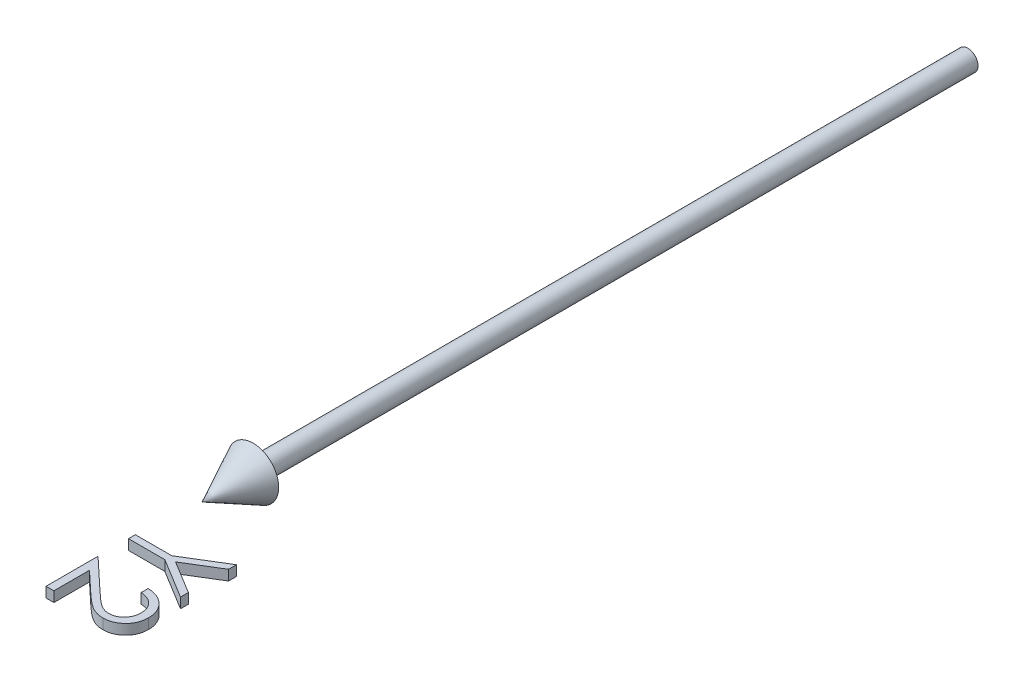
ISO-10303-21;
HEADER;
FILE_DESCRIPTION(('STEP AP214'),'2;1');
FILE_NAME('part.step','',(''),(''),'','','');
FILE_SCHEMA(('AUTOMOTIVE_DESIGN { 1 0 10303 214 1 1 1 1 }'));
ENDSEC;
DATA;
#1=APPLICATION_CONTEXT('core data for automotive mechanical design processes');
#2=APPLICATION_PROTOCOL_DEFINITION('international standard','automotive_design',2000,#1);
#3=PRODUCT_CONTEXT('',#1,'mechanical');
#4=PRODUCT('Part','Part','',(#3));
#5=PRODUCT_RELATED_PRODUCT_CATEGORY('part','',(#4));
#6=PRODUCT_DEFINITION_FORMATION('','',#4);
#7=PRODUCT_DEFINITION_CONTEXT('part definition',#1,'design');
#8=PRODUCT_DEFINITION('design','',#6,#7);
#9=PRODUCT_DEFINITION_SHAPE('','',#8);
#10=(LENGTH_UNIT() NAMED_UNIT(*) SI_UNIT(.MILLI.,.METRE.));
#11=(NAMED_UNIT(*) PLANE_ANGLE_UNIT() SI_UNIT($,.RADIAN.));
#12=(NAMED_UNIT(*) SI_UNIT($,.STERADIAN.) SOLID_ANGLE_UNIT());
#13=UNCERTAINTY_MEASURE_WITH_UNIT(LENGTH_MEASURE(1.E-05),#10,'distance_accuracy_value','');
#14=(GEOMETRIC_REPRESENTATION_CONTEXT(3) GLOBAL_UNCERTAINTY_ASSIGNED_CONTEXT((#13)) GLOBAL_UNIT_ASSIGNED_CONTEXT((#10,
#11,#12)) REPRESENTATION_CONTEXT('',''));
#15=CARTESIAN_POINT('',(0.,0.,0.));
#16=DIRECTION('',(0.,0.,1.));
#17=DIRECTION('',(1.,0.,0.));
#18=AXIS2_PLACEMENT_3D('',#15,#16,#17);
#19=CARTESIAN_POINT('',(13.8461538461538,1.,175.784254807692));
#20=CARTESIAN_POINT('',(13.8430903490205,1.,175.666950718059));
#21=CARTESIAN_POINT('',(13.8370741464776,1.,175.436584854593));
#22=CARTESIAN_POINT('',(13.7949638662532,1.,175.098367814316));
#23=CARTESIAN_POINT('',(13.7223866960572,1.,174.775687595804));
#24=CARTESIAN_POINT('',(13.6228849335806,1.,174.467891000634));
#25=CARTESIAN_POINT('',(13.4976114257859,1.,174.174681471077));
#26=CARTESIAN_POINT('',(13.3385672755579,1.,173.898710206654));
#27=CARTESIAN_POINT('',(13.1519621531288,1.,173.637457681242));
#28=CARTESIAN_POINT('',(12.9392424998358,1.,173.39140372161));
#29=CARTESIAN_POINT('',(12.701290356588,1.,173.165318738488));
#30=CARTESIAN_POINT('',(12.4393013545376,1.,172.962502138375));
#31=CARTESIAN_POINT('',(12.151571288189,1.,172.78952101788));
#32=CARTESIAN_POINT('',(11.8445991098928,1.,172.63618103993));
#33=CARTESIAN_POINT('',(11.5102228136177,1.,172.518853262642));
#34=CARTESIAN_POINT('',(11.1565451045167,1.,172.418562607741));
#35=CARTESIAN_POINT('',(10.7785410693277,1.,172.345708862392));
#36=CARTESIAN_POINT('',(10.5181048480713,1.,172.320574964717));
#37=CARTESIAN_POINT('',(10.3846153846154,1.,172.307692307692));
#38=B_SPLINE_CURVE_WITH_KNOTS('',3,(#19,#20,#21,#22,#23,#24,#25,#26,#27,#28,#29,#30,#31,#32,#33,
#34,#35,#36,#37),.UNSPECIFIED.,.F.,.F.,(4,1,1,1,1,1,1,1,1,1,1,1,1,1,1,1,4),(0.,
0.0644508040395069,0.126570737388967,0.186922340350207,0.245923829149238,0.304098129184294,
0.361780924437368,0.420576707079651,0.480272294873436,0.540223571985138,0.600657929141347,
0.66191615201073,0.724434636865271,0.788852535054683,0.856286703958642,0.926338161844397,1.),.UNSPECIFIED.);
#39=DIRECTION('',(0.,-1.,0.));
#40=VECTOR('',#39,1.);
#41=SURFACE_OF_LINEAR_EXTRUSION('',#38,#40);
#42=DIRECTION('',(0.,-1.,0.));
#43=VECTOR('',#42,1.);
#44=CARTESIAN_POINT('',(10.3846153846154,1.,172.307692307692));
#45=LINE('',#44,#43);
#46=CARTESIAN_POINT('',(10.3846153846154,1.,172.307692307692));
#47=VERTEX_POINT('',#46);
#48=CARTESIAN_POINT('',(10.3846153846154,-1.,172.307692307692));
#49=VERTEX_POINT('',#48);
#50=EDGE_CURVE('E50',#47,#49,#45,.T.);
#51=ORIENTED_EDGE('',*,*,#50,.T.);
#52=CARTESIAN_POINT('',(13.8461538461538,-1.,175.784254807692));
#53=CARTESIAN_POINT('',(13.8430903490205,-1.,175.666950718059));
#54=CARTESIAN_POINT('',(13.8370741464776,-1.,175.436584854593));
#55=CARTESIAN_POINT('',(13.7949638662532,-1.,175.098367814316));
#56=CARTESIAN_POINT('',(13.7223866960572,-1.,174.775687595804));
#57=CARTESIAN_POINT('',(13.6228849335806,-1.,174.467891000634));
#58=CARTESIAN_POINT('',(13.4976114257859,-1.,174.174681471077));
#59=CARTESIAN_POINT('',(13.3385672755579,-1.,173.898710206654));
#60=CARTESIAN_POINT('',(13.1519621531288,-1.,173.637457681242));
#61=CARTESIAN_POINT('',(12.9392424998358,-1.,173.39140372161));
#62=CARTESIAN_POINT('',(12.701290356588,-1.,173.165318738488));
#63=CARTESIAN_POINT('',(12.4393013545376,-1.,172.962502138375));
#64=CARTESIAN_POINT('',(12.151571288189,-1.,172.78952101788));
#65=CARTESIAN_POINT('',(11.8445991098928,-1.,172.63618103993));
#66=CARTESIAN_POINT('',(11.5102228136177,-1.,172.518853262642));
#67=CARTESIAN_POINT('',(11.1565451045167,-1.,172.418562607741));
#68=CARTESIAN_POINT('',(10.7785410693277,-1.,172.345708862392));
#69=CARTESIAN_POINT('',(10.5181048480713,-1.,172.320574964717));
#70=CARTESIAN_POINT('',(10.3846153846154,-1.,172.307692307692));
#71=B_SPLINE_CURVE_WITH_KNOTS('',3,(#52,#53,#54,#55,#56,#57,#58,#59,#60,#61,#62,#63,#64,#65,#66,
#67,#68,#69,#70),.UNSPECIFIED.,.F.,.F.,(4,1,1,1,1,1,1,1,1,1,1,1,1,1,1,1,4),(0.,
0.0644508040395069,0.126570737388967,0.186922340350207,0.245923829149238,0.304098129184294,
0.361780924437368,0.420576707079651,0.480272294873436,0.540223571985138,0.600657929141347,
0.66191615201073,0.724434636865271,0.788852535054683,0.856286703958642,0.926338161844397,1.),.UNSPECIFIED.);
#72=CARTESIAN_POINT('',(13.8461538461538,-1.,175.784254807692));
#73=VERTEX_POINT('',#72);
#74=EDGE_CURVE('E135',#73,#49,#71,.T.);
#75=ORIENTED_EDGE('',*,*,#74,.F.);
#76=DIRECTION('',(0.,-1.,0.));
#77=VECTOR('',#76,1.);
#78=CARTESIAN_POINT('',(13.8461538461538,1.,175.784254807692));
#79=LINE('',#78,#77);
#80=CARTESIAN_POINT('',(13.8461538461538,1.,175.784254807692));
#81=VERTEX_POINT('',#80);
#82=EDGE_CURVE('E12',#81,#73,#79,.T.);
#83=ORIENTED_EDGE('',*,*,#82,.F.);
#84=EDGE_CURVE('E136',#81,#47,#38,.T.);
#85=ORIENTED_EDGE('',*,*,#84,.T.);
#86=EDGE_LOOP('',(#51,#75,#83,#85));
#87=FACE_BOUND('',#86,.T.);
#88=ADVANCED_FACE('F46',(#87),#41,.T.);
#89=CARTESIAN_POINT('',(10.8052884615385,1.,179.038461538461));
#90=CARTESIAN_POINT('',(10.907648621887,1.,179.035764915721));
#91=CARTESIAN_POINT('',(11.1093808418776,1.,179.030450390128));
#92=CARTESIAN_POINT('',(11.4049575306741,1.,178.982658693181));
#93=CARTESIAN_POINT('',(11.6911812335126,1.,178.912443204752));
#94=CARTESIAN_POINT('',(11.9645129994275,1.,178.804219446614));
#95=CARTESIAN_POINT('',(12.2303287358917,1.,178.674192585995));
#96=CARTESIAN_POINT('',(12.4805468155156,1.,178.50807368318));
#97=CARTESIAN_POINT('',(12.7236965720784,1.,178.318243399908));
#98=CARTESIAN_POINT('',(12.9514406019576,1.,178.098049582473));
#99=CARTESIAN_POINT('',(13.1600894980569,1.,177.856317685058));
#100=CARTESIAN_POINT('',(13.3449030478262,1.,177.600905463265));
#101=CARTESIAN_POINT('',(13.4993574131545,1.,177.330692895708));
#102=CARTESIAN_POINT('',(13.6259721242595,1.,177.046806077852));
#103=CARTESIAN_POINT('',(13.725295261767,1.,176.750039938021));
#104=CARTESIAN_POINT('',(13.7941177246169,1.,176.439819559058));
#105=CARTESIAN_POINT('',(13.837328375683,1.,176.11700235811));
#106=CARTESIAN_POINT('',(13.8431748259449,1.,175.896573089243));
#107=CARTESIAN_POINT('',(13.8461538461538,1.,175.784254807692));
#108=B_SPLINE_CURVE_WITH_KNOTS('',3,(#89,#90,#91,#92,#93,#94,#95,#96,#97,#98,#99,#100,#101,#102,
#103,#104,#105,#106,#107),.UNSPECIFIED.,.F.,.F.,(4,1,1,1,1,1,1,1,1,1,1,1,1,1,1,1,4),(0.,
0.0619690391917485,0.122129076432336,0.180999124191659,0.240162416544851,0.299864722747891,
0.359951267092581,0.421741789380327,0.486545679012397,0.551508471493566,0.614994937234004,
0.677239665827439,0.739714679741424,0.803038538094396,0.86648729283315,0.931969479773336,1.),.UNSPECIFIED.);
#109=DIRECTION('',(0.,-1.,0.));
#110=VECTOR('',#109,1.);
#111=SURFACE_OF_LINEAR_EXTRUSION('',#108,#110);
#112=ORIENTED_EDGE('',*,*,#82,.T.);
#113=CARTESIAN_POINT('',(10.8052884615385,-1.,179.038461538461));
#114=CARTESIAN_POINT('',(10.907648621887,-1.,179.035764915721));
#115=CARTESIAN_POINT('',(11.1093808418776,-1.,179.030450390128));
#116=CARTESIAN_POINT('',(11.4049575306741,-1.,178.982658693181));
#117=CARTESIAN_POINT('',(11.6911812335126,-1.,178.912443204752));
#118=CARTESIAN_POINT('',(11.9645129994275,-1.,178.804219446614));
#119=CARTESIAN_POINT('',(12.2303287358917,-1.,178.674192585995));
#120=CARTESIAN_POINT('',(12.4805468155156,-1.,178.50807368318));
#121=CARTESIAN_POINT('',(12.7236965720784,-1.,178.318243399908));
#122=CARTESIAN_POINT('',(12.9514406019576,-1.,178.098049582473));
#123=CARTESIAN_POINT('',(13.1600894980569,-1.,177.856317685058));
#124=CARTESIAN_POINT('',(13.3449030478262,-1.,177.600905463265));
#125=CARTESIAN_POINT('',(13.4993574131545,-1.,177.330692895708));
#126=CARTESIAN_POINT('',(13.6259721242595,-1.,177.046806077852));
#127=CARTESIAN_POINT('',(13.725295261767,-1.,176.750039938021));
#128=CARTESIAN_POINT('',(13.7941177246169,-1.,176.439819559058));
#129=CARTESIAN_POINT('',(13.837328375683,-1.,176.11700235811));
#130=CARTESIAN_POINT('',(13.8431748259449,-1.,175.896573089243));
#131=CARTESIAN_POINT('',(13.8461538461538,-1.,175.784254807692));
#132=B_SPLINE_CURVE_WITH_KNOTS('',3,(#113,#114,#115,#116,#117,#118,#119,#120,#121,#122,#123,
#124,#125,#126,#127,#128,#129,#130,#131),.UNSPECIFIED.,.F.,.F.,(4,1,1,1,1,1,1,1,1,1,1,1,1,1,1,1,
4),(0.,0.0619690391917485,0.122129076432336,0.180999124191659,0.240162416544851,
0.299864722747891,0.359951267092581,0.421741789380327,0.486545679012397,0.551508471493566,
0.614994937234004,0.677239665827439,0.739714679741424,0.803038538094396,0.86648729283315,
0.931969479773336,1.),.UNSPECIFIED.);
#133=CARTESIAN_POINT('',(10.8052884615385,-1.,179.038461538461));
#134=VERTEX_POINT('',#133);
#135=EDGE_CURVE('E153',#134,#73,#132,.T.);
#136=ORIENTED_EDGE('',*,*,#135,.F.);
#137=DIRECTION('',(0.,-1.,0.));
#138=VECTOR('',#137,1.);
#139=CARTESIAN_POINT('',(10.8052884615385,1.,179.038461538461));
#140=LINE('',#139,#138);
#141=CARTESIAN_POINT('',(10.8052884615385,1.,179.038461538461));
#142=VERTEX_POINT('',#141);
#143=EDGE_CURVE('E55',#142,#134,#140,.T.);
#144=ORIENTED_EDGE('',*,*,#143,.F.);
#145=EDGE_CURVE('E141',#142,#81,#108,.T.);
#146=ORIENTED_EDGE('',*,*,#145,.T.);
#147=EDGE_LOOP('',(#112,#136,#144,#146));
#148=FACE_BOUND('',#147,.T.);
#149=ADVANCED_FACE('F248',(#148),#111,.T.);
#150=CARTESIAN_POINT('',(6.20793269230769,1.,176.201923076923));
#151=CARTESIAN_POINT('',(6.35577451350385,1.,176.343566905076));
#152=CARTESIAN_POINT('',(6.63974839534769,1.,176.615635710738));
#153=CARTESIAN_POINT('',(7.05446717563904,1.,177.00028625556));
#154=CARTESIAN_POINT('',(7.43875575802217,1.,177.346320010716));
#155=CARTESIAN_POINT('',(7.79431701645155,1.,177.653966515673));
#156=CARTESIAN_POINT('',(8.11913525102183,1.,177.923478904145));
#157=CARTESIAN_POINT('',(8.41575598564455,1.,178.153994854752));
#158=CARTESIAN_POINT('',(8.68163370775044,1.,178.346533206419));
#159=CARTESIAN_POINT('',(8.99397573851116,1.,178.550583736915));
#160=CARTESIAN_POINT('',(9.37577943995211,1.,178.745159458079));
#161=CARTESIAN_POINT('',(9.84001655898879,1.,178.916171607461));
#162=CARTESIAN_POINT('',(10.3189691013218,1.,179.019700036082));
#163=CARTESIAN_POINT('',(10.6425330310132,1.,179.03218266773));
#164=CARTESIAN_POINT('',(10.8052884615385,1.,179.038461538461));
#165=B_SPLINE_CURVE_WITH_KNOTS('',3,(#150,#151,#152,#153,#154,#155,#156,#157,#158,#159,#160,
#161,#162,#163,#164),.UNSPECIFIED.,.F.,.F.,(4,1,1,1,1,1,1,1,1,1,1,1,4),(0.,0.110794173487163,
0.212812932607773,0.306077909891767,0.390617458060213,0.467232726697906,0.534450618381699,
0.593866801498851,0.644832968632605,0.736220618800178,0.825037401666782,0.911992313096533,1.),.UNSPECIFIED.);
#166=DIRECTION('',(0.,-1.,0.));
#167=VECTOR('',#166,1.);
#168=SURFACE_OF_LINEAR_EXTRUSION('',#165,#167);
#169=ORIENTED_EDGE('',*,*,#143,.T.);
#170=CARTESIAN_POINT('',(6.20793269230769,-1.,176.201923076923));
#171=CARTESIAN_POINT('',(6.35577451350385,-1.,176.343566905076));
#172=CARTESIAN_POINT('',(6.63974839534769,-1.,176.615635710738));
#173=CARTESIAN_POINT('',(7.05446717563904,-1.,177.00028625556));
#174=CARTESIAN_POINT('',(7.43875575802217,-1.,177.346320010716));
#175=CARTESIAN_POINT('',(7.79431701645155,-1.,177.653966515673));
#176=CARTESIAN_POINT('',(8.11913525102183,-1.,177.923478904145));
#177=CARTESIAN_POINT('',(8.41575598564455,-1.,178.153994854752));
#178=CARTESIAN_POINT('',(8.68163370775044,-1.,178.346533206419));
#179=CARTESIAN_POINT('',(8.99397573851116,-1.,178.550583736915));
#180=CARTESIAN_POINT('',(9.37577943995211,-1.,178.745159458079));
#181=CARTESIAN_POINT('',(9.84001655898879,-1.,178.916171607461));
#182=CARTESIAN_POINT('',(10.3189691013218,-1.,179.019700036082));
#183=CARTESIAN_POINT('',(10.6425330310132,-1.,179.03218266773));
#184=CARTESIAN_POINT('',(10.8052884615385,-1.,179.038461538461));
#185=B_SPLINE_CURVE_WITH_KNOTS('',3,(#170,#171,#172,#173,#174,#175,#176,#177,#178,#179,#180,
#181,#182,#183,#184),.UNSPECIFIED.,.F.,.F.,(4,1,1,1,1,1,1,1,1,1,1,1,4),(0.,0.110794173487163,
0.212812932607773,0.306077909891767,0.390617458060213,0.467232726697906,0.534450618381699,
0.593866801498851,0.644832968632605,0.736220618800178,0.825037401666782,0.911992313096533,1.),.UNSPECIFIED.);
#186=CARTESIAN_POINT('',(6.20793269230769,-1.,176.201923076923));
#187=VERTEX_POINT('',#186);
#188=EDGE_CURVE('E198',#187,#134,#185,.T.);
#189=ORIENTED_EDGE('',*,*,#188,.F.);
#190=DIRECTION('',(0.,-1.,0.));
#191=VECTOR('',#190,1.);
#192=CARTESIAN_POINT('',(6.20793269230769,1.,176.201923076923));
#193=LINE('',#192,#191);
#194=CARTESIAN_POINT('',(6.20793269230769,1.,176.201923076923));
#195=VERTEX_POINT('',#194);
#196=EDGE_CURVE('E277',#195,#187,#193,.T.);
#197=ORIENTED_EDGE('',*,*,#196,.F.);
#198=EDGE_CURVE('E267',#195,#142,#165,.T.);
#199=ORIENTED_EDGE('',*,*,#198,.T.);
#200=EDGE_LOOP('',(#169,#189,#197,#199));
#201=FACE_BOUND('',#200,.T.);
#202=ADVANCED_FACE('F252',(#201),#168,.T.);
#203=CARTESIAN_POINT('',(0.,1.,170.384615384615));
#204=DIRECTION('',(0.683776631973392,0.,-0.729691385153425));
#205=DIRECTION('',(-0.729691385153425,0.,-0.683776631973392));
#206=AXIS2_PLACEMENT_3D('',#203,#204,#205);
#207=PLANE('',#206);
#208=ORIENTED_EDGE('',*,*,#196,.T.);
#209=DIRECTION('',(0.729691385153425,0.,0.683776631973392));
#210=VECTOR('',#209,1.);
#211=CARTESIAN_POINT('',(0.,-1.,170.384615384615));
#212=LINE('',#211,#210);
#213=CARTESIAN_POINT('',(0.,-1.,170.384615384615));
#214=VERTEX_POINT('',#213);
#215=EDGE_CURVE('E195',#214,#187,#212,.T.);
#216=ORIENTED_EDGE('',*,*,#215,.F.);
#217=DIRECTION('',(0.,-1.,0.));
#218=VECTOR('',#217,1.);
#219=CARTESIAN_POINT('',(0.,1.,170.384615384615));
#220=LINE('',#219,#218);
#221=CARTESIAN_POINT('',(0.,1.,170.384615384615));
#222=VERTEX_POINT('',#221);
#223=EDGE_CURVE('E279',#222,#214,#220,.T.);
#224=ORIENTED_EDGE('',*,*,#223,.F.);
#225=DIRECTION('',(0.729691385153425,0.,0.683776631973392));
#226=VECTOR('',#225,1.);
#227=CARTESIAN_POINT('',(0.,1.,170.384615384615));
#228=LINE('',#227,#226);
#229=EDGE_CURVE('E340',#222,#195,#228,.T.);
#230=ORIENTED_EDGE('',*,*,#229,.T.);
#231=EDGE_LOOP('',(#208,#216,#224,#230));
#232=FACE_BOUND('',#231,.T.);
#233=ADVANCED_FACE('F257',(#232),#207,.T.);
#234=CARTESIAN_POINT('',(0.,1.,180.576923076923));
#235=DIRECTION('',(-1.,0.,0.));
#236=DIRECTION('',(0.,0.,1.));
#237=AXIS2_PLACEMENT_3D('',#234,#235,#236);
#238=PLANE('',#237);
#239=ORIENTED_EDGE('',*,*,#223,.T.);
#240=DIRECTION('',(0.,0.,-1.));
#241=VECTOR('',#240,1.);
#242=CARTESIAN_POINT('',(0.,-1.,180.576923076923));
#243=LINE('',#242,#241);
#244=CARTESIAN_POINT('',(0.,-1.,180.576923076923));
#245=VERTEX_POINT('',#244);
#246=EDGE_CURVE('E192',#245,#214,#243,.T.);
#247=ORIENTED_EDGE('',*,*,#246,.F.);
#248=DIRECTION('',(0.,-1.,0.));
#249=VECTOR('',#248,1.);
#250=CARTESIAN_POINT('',(0.,1.,180.576923076923));
#251=LINE('',#250,#249);
#252=CARTESIAN_POINT('',(0.,1.,180.576923076923));
#253=VERTEX_POINT('',#252);
#254=EDGE_CURVE('E281',#253,#245,#251,.T.);
#255=ORIENTED_EDGE('',*,*,#254,.F.);
#256=DIRECTION('',(0.,0.,-1.));
#257=VECTOR('',#256,1.);
#258=CARTESIAN_POINT('',(0.,1.,180.576923076923));
#259=LINE('',#258,#257);
#260=EDGE_CURVE('E345',#253,#222,#259,.T.);
#261=ORIENTED_EDGE('',*,*,#260,.T.);
#262=EDGE_LOOP('',(#239,#247,#255,#261));
#263=FACE_BOUND('',#262,.T.);
#264=ADVANCED_FACE('F329',(#263),#238,.T.);
#265=CARTESIAN_POINT('',(1.53846153846154,1.,180.576923076923));
#266=DIRECTION('',(0.,0.,1.));
#267=DIRECTION('',(1.,0.,0.));
#268=AXIS2_PLACEMENT_3D('',#265,#266,#267);
#269=PLANE('',#268);
#270=ORIENTED_EDGE('',*,*,#254,.T.);
#271=DIRECTION('',(-1.,0.,0.));
#272=VECTOR('',#271,1.);
#273=CARTESIAN_POINT('',(1.53846153846154,-1.,180.576923076923));
#274=LINE('',#273,#272);
#275=CARTESIAN_POINT('',(1.53846153846154,-1.,180.576923076923));
#276=VERTEX_POINT('',#275);
#277=EDGE_CURVE('E189',#276,#245,#274,.T.);
#278=ORIENTED_EDGE('',*,*,#277,.F.);
#279=DIRECTION('',(0.,-1.,0.));
#280=VECTOR('',#279,1.);
#281=CARTESIAN_POINT('',(1.53846153846154,1.,180.576923076923));
#282=LINE('',#281,#280);
#283=CARTESIAN_POINT('',(1.53846153846154,1.,180.576923076923));
#284=VERTEX_POINT('',#283);
#285=EDGE_CURVE('E283',#284,#276,#282,.T.);
#286=ORIENTED_EDGE('',*,*,#285,.F.);
#287=DIRECTION('',(-1.,0.,0.));
#288=VECTOR('',#287,1.);
#289=CARTESIAN_POINT('',(1.53846153846154,1.,180.576923076923));
#290=LINE('',#289,#288);
#291=EDGE_CURVE('E347',#284,#253,#290,.T.);
#292=ORIENTED_EDGE('',*,*,#291,.T.);
#293=EDGE_LOOP('',(#270,#278,#286,#292));
#294=FACE_BOUND('',#293,.T.);
#295=ADVANCED_FACE('F325',(#294),#269,.T.);
#296=CARTESIAN_POINT('',(1.53846153846154,1.,173.596754807692));
#297=DIRECTION('',(1.,0.,0.));
#298=DIRECTION('',(0.,0.,-1.));
#299=AXIS2_PLACEMENT_3D('',#296,#297,#298);
#300=PLANE('',#299);
#301=ORIENTED_EDGE('',*,*,#285,.T.);
#302=DIRECTION('',(0.,0.,1.));
#303=VECTOR('',#302,1.);
#304=CARTESIAN_POINT('',(1.53846153846154,-1.,173.596754807692));
#305=LINE('',#304,#303);
#306=CARTESIAN_POINT('',(1.53846153846154,-1.,173.596754807692));
#307=VERTEX_POINT('',#306);
#308=EDGE_CURVE('E186',#307,#276,#305,.T.);
#309=ORIENTED_EDGE('',*,*,#308,.F.);
#310=DIRECTION('',(0.,-1.,0.));
#311=VECTOR('',#310,1.);
#312=CARTESIAN_POINT('',(1.53846153846154,1.,173.596754807692));
#313=LINE('',#312,#311);
#314=CARTESIAN_POINT('',(1.53846153846154,1.,173.596754807692));
#315=VERTEX_POINT('',#314);
#316=EDGE_CURVE('E285',#315,#307,#313,.T.);
#317=ORIENTED_EDGE('',*,*,#316,.F.);
#318=DIRECTION('',(0.,0.,1.));
#319=VECTOR('',#318,1.);
#320=CARTESIAN_POINT('',(1.53846153846154,1.,173.596754807692));
#321=LINE('',#320,#319);
#322=EDGE_CURVE('E307',#315,#284,#321,.T.);
#323=ORIENTED_EDGE('',*,*,#322,.T.);
#324=EDGE_LOOP('',(#301,#309,#317,#323));
#325=FACE_BOUND('',#324,.T.);
#326=ADVANCED_FACE('F321',(#325),#300,.T.);
#327=CARTESIAN_POINT('',(5.54387019230769,1.,177.349759615385));
#328=DIRECTION('',(-0.683740795861405,0.,0.729724964678345));
#329=DIRECTION('',(0.729724964678345,0.,0.683740795861405));
#330=AXIS2_PLACEMENT_3D('',#327,#328,#329);
#331=PLANE('',#330);
#332=ORIENTED_EDGE('',*,*,#316,.T.);
#333=DIRECTION('',(-0.729724964678345,0.,-0.683740795861405));
#334=VECTOR('',#333,1.);
#335=CARTESIAN_POINT('',(5.54387019230769,-1.,177.349759615385));
#336=LINE('',#335,#334);
#337=CARTESIAN_POINT('',(5.54387019230769,-1.,177.349759615385));
#338=VERTEX_POINT('',#337);
#339=EDGE_CURVE('E180',#338,#307,#336,.T.);
#340=ORIENTED_EDGE('',*,*,#339,.F.);
#341=DIRECTION('',(0.,-1.,0.));
#342=VECTOR('',#341,1.);
#343=CARTESIAN_POINT('',(5.54387019230769,1.,177.349759615385));
#344=LINE('',#343,#342);
#345=CARTESIAN_POINT('',(5.54387019230769,1.,177.349759615385));
#346=VERTEX_POINT('',#345);
#347=EDGE_CURVE('E287',#346,#338,#344,.T.);
#348=ORIENTED_EDGE('',*,*,#347,.F.);
#349=DIRECTION('',(-0.729724964678345,0.,-0.683740795861405));
#350=VECTOR('',#349,1.);
#351=CARTESIAN_POINT('',(5.54387019230769,1.,177.349759615385));
#352=LINE('',#351,#350);
#353=EDGE_CURVE('E306',#346,#315,#352,.T.);
#354=ORIENTED_EDGE('',*,*,#353,.T.);
#355=EDGE_LOOP('',(#332,#340,#348,#354));
#356=FACE_BOUND('',#355,.T.);
#357=ADVANCED_FACE('F318',(#356),#331,.T.);
#358=CARTESIAN_POINT('',(10.9254807692308,1.,180.384615384615));
#359=CARTESIAN_POINT('',(10.7165614781958,1.,180.377358543802));
#360=CARTESIAN_POINT('',(10.3023891338936,1.,180.362972209457));
#361=CARTESIAN_POINT('',(9.69375400782562,1.,180.239910595596));
#362=CARTESIAN_POINT('',(9.10406792602558,1.,180.04771126233));
#363=CARTESIAN_POINT('',(8.62947948852082,1.,179.81629401869));
#364=CARTESIAN_POINT('',(8.24705022956211,1.,179.582840686997));
#365=CARTESIAN_POINT('',(7.93218435133463,1.,179.372465654453));
#366=CARTESIAN_POINT('',(7.59316091538009,1.,179.126187892931));
#367=CARTESIAN_POINT('',(7.23111518377741,1.,178.840422901662));
#368=CARTESIAN_POINT('',(6.84321130478359,1.,178.521082021016));
#369=CARTESIAN_POINT('',(6.42968361021899,1.,178.165272749488));
#370=CARTESIAN_POINT('',(5.99480459670448,1.,177.770457826539));
#371=CARTESIAN_POINT('',(5.69778059075664,1.,177.493349966163));
#372=CARTESIAN_POINT('',(5.54387019230769,1.,177.349759615385));
#373=B_SPLINE_CURVE_WITH_KNOTS('',3,(#358,#359,#360,#361,#362,#363,#364,#365,#366,#367,#368,
#369,#370,#371,#372),.UNSPECIFIED.,.F.,.F.,(4,1,1,1,1,1,1,1,1,1,1,1,4),(0.,0.0987021963061524,
0.195672308810664,0.292422426507954,0.391342543799824,0.444462440671891,0.504228775449315,
0.570352337994678,0.642545753097747,0.722287505344018,0.807921122682712,0.900469537985015,1.),.UNSPECIFIED.);
#374=DIRECTION('',(0.,-1.,0.));
#375=VECTOR('',#374,1.);
#376=SURFACE_OF_LINEAR_EXTRUSION('',#373,#375);
#377=ORIENTED_EDGE('',*,*,#347,.T.);
#378=CARTESIAN_POINT('',(10.9254807692308,-1.,180.384615384615));
#379=CARTESIAN_POINT('',(10.7165614781958,-1.,180.377358543802));
#380=CARTESIAN_POINT('',(10.3023891338936,-1.,180.362972209457));
#381=CARTESIAN_POINT('',(9.69375400782562,-1.,180.239910595596));
#382=CARTESIAN_POINT('',(9.10406792602558,-1.,180.04771126233));
#383=CARTESIAN_POINT('',(8.62947948852082,-1.,179.81629401869));
#384=CARTESIAN_POINT('',(8.24705022956211,-1.,179.582840686997));
#385=CARTESIAN_POINT('',(7.93218435133463,-1.,179.372465654453));
#386=CARTESIAN_POINT('',(7.59316091538009,-1.,179.126187892931));
#387=CARTESIAN_POINT('',(7.23111518377741,-1.,178.840422901662));
#388=CARTESIAN_POINT('',(6.84321130478359,-1.,178.521082021016));
#389=CARTESIAN_POINT('',(6.42968361021899,-1.,178.165272749488));
#390=CARTESIAN_POINT('',(5.99480459670448,-1.,177.770457826539));
#391=CARTESIAN_POINT('',(5.69778059075664,-1.,177.493349966163));
#392=CARTESIAN_POINT('',(5.54387019230769,-1.,177.349759615385));
#393=B_SPLINE_CURVE_WITH_KNOTS('',3,(#378,#379,#380,#381,#382,#383,#384,#385,#386,#387,#388,
#389,#390,#391,#392),.UNSPECIFIED.,.F.,.F.,(4,1,1,1,1,1,1,1,1,1,1,1,4),(0.,0.0987021963061524,
0.195672308810664,0.292422426507954,0.391342543799824,0.444462440671891,0.504228775449315,
0.570352337994678,0.642545753097747,0.722287505344018,0.807921122682712,0.900469537985015,1.),.UNSPECIFIED.);
#394=CARTESIAN_POINT('',(10.9254807692308,-1.,180.384615384615));
#395=VERTEX_POINT('',#394);
#396=EDGE_CURVE('E172',#395,#338,#393,.T.);
#397=ORIENTED_EDGE('',*,*,#396,.F.);
#398=DIRECTION('',(0.,-1.,0.));
#399=VECTOR('',#398,1.);
#400=CARTESIAN_POINT('',(10.9254807692308,1.,180.384615384615));
#401=LINE('',#400,#399);
#402=CARTESIAN_POINT('',(10.9254807692308,1.,180.384615384615));
#403=VERTEX_POINT('',#402);
#404=EDGE_CURVE('E289',#403,#395,#401,.T.);
#405=ORIENTED_EDGE('',*,*,#404,.F.);
#406=EDGE_CURVE('E302',#403,#346,#373,.T.);
#407=ORIENTED_EDGE('',*,*,#406,.T.);
#408=EDGE_LOOP('',(#377,#397,#405,#407));
#409=FACE_BOUND('',#408,.T.);
#410=ADVANCED_FACE('F301',(#409),#376,.T.);
#411=CARTESIAN_POINT('',(15.3846153846154,1.,175.853365384615));
#412=CARTESIAN_POINT('',(15.3807648569921,1.,176.01784284499));
#413=CARTESIAN_POINT('',(15.3731987077593,1.,176.341035179231));
#414=CARTESIAN_POINT('',(15.3082228680426,1.,176.812729526887));
#415=CARTESIAN_POINT('',(15.2064560467485,1.,177.261775074587));
#416=CARTESIAN_POINT('',(15.0636756911201,1.,177.687294073966));
#417=CARTESIAN_POINT('',(14.8717424308664,1.,178.085891493557));
#418=CARTESIAN_POINT('',(14.6411815509029,1.,178.460561684513));
#419=CARTESIAN_POINT('',(14.3745251307365,1.,178.815765159332));
#420=CARTESIAN_POINT('',(14.0605802159577,1.,179.13550851767));
#421=CARTESIAN_POINT('',(13.7254271396561,1.,179.429114571539));
#422=CARTESIAN_POINT('',(13.3676218384612,1.,179.682409950729));
#423=CARTESIAN_POINT('',(12.9980677568254,1.,179.899323508472));
#424=CARTESIAN_POINT('',(12.6139468929046,1.,180.08012785082));
#425=CARTESIAN_POINT('',(12.2116424854217,1.,180.21322558913));
#426=CARTESIAN_POINT('',(11.7970116163146,1.,180.314275052113));
#427=CARTESIAN_POINT('',(11.3657624262865,1.,180.371392539348));
#428=CARTESIAN_POINT('',(11.0738771877961,1.,180.380158640053));
#429=CARTESIAN_POINT('',(10.9254807692308,1.,180.384615384615));
#430=B_SPLINE_CURVE_WITH_KNOTS('',3,(#411,#412,#413,#414,#415,#416,#417,#418,#419,#420,#421,
#422,#423,#424,#425,#426,#427,#428,#429),.UNSPECIFIED.,.F.,.F.,(4,1,1,1,1,1,1,1,1,1,1,1,1,1,1,1,
4),(0.,0.0694754602496714,0.136516797617798,0.20078882360926,0.263829672855826,0.32573502296542,
0.387290692215292,0.449509218762602,0.512967819545441,0.57627521549306,0.637580100263924,
0.697902605917102,0.757172088426985,0.816598528488655,0.87665317089282,0.93728964241024,1.),.UNSPECIFIED.);
#431=DIRECTION('',(0.,-1.,0.));
#432=VECTOR('',#431,1.);
#433=SURFACE_OF_LINEAR_EXTRUSION('',#430,#432);
#434=ORIENTED_EDGE('',*,*,#404,.T.);
#435=CARTESIAN_POINT('',(15.3846153846154,-1.,175.853365384615));
#436=CARTESIAN_POINT('',(15.3807648569921,-1.,176.01784284499));
#437=CARTESIAN_POINT('',(15.3731987077593,-1.,176.341035179231));
#438=CARTESIAN_POINT('',(15.3082228680426,-1.,176.812729526887));
#439=CARTESIAN_POINT('',(15.2064560467485,-1.,177.261775074587));
#440=CARTESIAN_POINT('',(15.0636756911201,-1.,177.687294073966));
#441=CARTESIAN_POINT('',(14.8717424308664,-1.,178.085891493557));
#442=CARTESIAN_POINT('',(14.6411815509029,-1.,178.460561684513));
#443=CARTESIAN_POINT('',(14.3745251307365,-1.,178.815765159332));
#444=CARTESIAN_POINT('',(14.0605802159577,-1.,179.13550851767));
#445=CARTESIAN_POINT('',(13.7254271396561,-1.,179.429114571539));
#446=CARTESIAN_POINT('',(13.3676218384612,-1.,179.682409950729));
#447=CARTESIAN_POINT('',(12.9980677568254,-1.,179.899323508472));
#448=CARTESIAN_POINT('',(12.6139468929046,-1.,180.08012785082));
#449=CARTESIAN_POINT('',(12.2116424854217,-1.,180.21322558913));
#450=CARTESIAN_POINT('',(11.7970116163146,-1.,180.314275052113));
#451=CARTESIAN_POINT('',(11.3657624262865,-1.,180.371392539348));
#452=CARTESIAN_POINT('',(11.0738771877961,-1.,180.380158640053));
#453=CARTESIAN_POINT('',(10.9254807692308,-1.,180.384615384615));
#454=B_SPLINE_CURVE_WITH_KNOTS('',3,(#435,#436,#437,#438,#439,#440,#441,#442,#443,#444,#445,
#446,#447,#448,#449,#450,#451,#452,#453),.UNSPECIFIED.,.F.,.F.,(4,1,1,1,1,1,1,1,1,1,1,1,1,1,1,1,
4),(0.,0.0694754602496714,0.136516797617798,0.20078882360926,0.263829672855826,0.32573502296542,
0.387290692215292,0.449509218762602,0.512967819545441,0.57627521549306,0.637580100263924,
0.697902605917102,0.757172088426985,0.816598528488655,0.87665317089282,0.93728964241024,1.),.UNSPECIFIED.);
#455=CARTESIAN_POINT('',(15.3846153846154,-1.,175.853365384615));
#456=VERTEX_POINT('',#455);
#457=EDGE_CURVE('E164',#456,#395,#454,.T.);
#458=ORIENTED_EDGE('',*,*,#457,.F.);
#459=DIRECTION('',(0.,-1.,0.));
#460=VECTOR('',#459,1.);
#461=CARTESIAN_POINT('',(15.3846153846154,1.,175.853365384615));
#462=LINE('',#461,#460);
#463=CARTESIAN_POINT('',(15.3846153846154,1.,175.853365384615));
#464=VERTEX_POINT('',#463);
#465=EDGE_CURVE('E291',#464,#456,#462,.T.);
#466=ORIENTED_EDGE('',*,*,#465,.F.);
#467=EDGE_CURVE('E225',#464,#403,#430,.T.);
#468=ORIENTED_EDGE('',*,*,#467,.T.);
#469=EDGE_LOOP('',(#434,#458,#466,#468));
#470=FACE_BOUND('',#469,.T.);
#471=ADVANCED_FACE('F237',(#470),#433,.T.);
#472=CARTESIAN_POINT('',(10.3846153846154,1.,170.961538461538));
#473=CARTESIAN_POINT('',(10.5632057839513,1.,170.970310481064));
#474=CARTESIAN_POINT('',(10.9139525753619,1.,170.98753849396));
#475=CARTESIAN_POINT('',(11.4253282889843,1.,171.068252293303));
#476=CARTESIAN_POINT('',(11.914179652672,1.,171.183636717506));
#477=CARTESIAN_POINT('',(12.376315664304,1.,171.347163365312));
#478=CARTESIAN_POINT('',(12.8172569262653,1.,171.5491044852));
#479=CARTESIAN_POINT('',(13.2311482486789,1.,171.796338855459));
#480=CARTESIAN_POINT('',(13.6220974538477,1.,172.083595839737));
#481=CARTESIAN_POINT('',(13.9827025768391,1.,172.410348453629));
#482=CARTESIAN_POINT('',(14.3123407452399,1.,172.764905154472));
#483=CARTESIAN_POINT('',(14.6000125222947,1.,173.145141596399));
#484=CARTESIAN_POINT('',(14.8402861710031,1.,173.547149667402));
#485=CARTESIAN_POINT('',(15.0422417140498,1.,173.967442521605));
#486=CARTESIAN_POINT('',(15.1936498085756,1.,174.410880969964));
#487=CARTESIAN_POINT('',(15.3060414749433,1.,174.873226237212));
#488=CARTESIAN_POINT('',(15.3736507817658,1.,175.356568076606));
#489=CARTESIAN_POINT('',(15.3809189317183,1.,175.685882086436));
#490=CARTESIAN_POINT('',(15.3846153846154,1.,175.853365384615));
#491=B_SPLINE_CURVE_WITH_KNOTS('',3,(#472,#473,#474,#475,#476,#477,#478,#479,#480,#481,#482,
#483,#484,#485,#486,#487,#488,#489,#490),.UNSPECIFIED.,.F.,.F.,(4,1,1,1,1,1,1,1,1,1,1,1,1,1,1,1,
4),(0.,0.0687985167452402,0.135118455930088,0.199001011367505,0.261933700776991,
0.323531284443178,0.385434720566548,0.447215515985122,0.510018103283326,0.572510909991794,
0.633364022258851,0.693216727743023,0.752555388131032,0.812558226574171,0.873260858965363,
0.935542707825268,1.),.UNSPECIFIED.);
#492=DIRECTION('',(0.,-1.,0.));
#493=VECTOR('',#492,1.);
#494=SURFACE_OF_LINEAR_EXTRUSION('',#491,#493);
#495=ORIENTED_EDGE('',*,*,#465,.T.);
#496=CARTESIAN_POINT('',(10.3846153846154,-1.,170.961538461538));
#497=CARTESIAN_POINT('',(10.5632057839513,-1.,170.970310481064));
#498=CARTESIAN_POINT('',(10.9139525753619,-1.,170.98753849396));
#499=CARTESIAN_POINT('',(11.4253282889843,-1.,171.068252293303));
#500=CARTESIAN_POINT('',(11.914179652672,-1.,171.183636717506));
#501=CARTESIAN_POINT('',(12.376315664304,-1.,171.347163365312));
#502=CARTESIAN_POINT('',(12.8172569262653,-1.,171.5491044852));
#503=CARTESIAN_POINT('',(13.2311482486789,-1.,171.796338855459));
#504=CARTESIAN_POINT('',(13.6220974538477,-1.,172.083595839737));
#505=CARTESIAN_POINT('',(13.9827025768391,-1.,172.410348453629));
#506=CARTESIAN_POINT('',(14.3123407452399,-1.,172.764905154472));
#507=CARTESIAN_POINT('',(14.6000125222947,-1.,173.145141596399));
#508=CARTESIAN_POINT('',(14.8402861710031,-1.,173.547149667402));
#509=CARTESIAN_POINT('',(15.0422417140498,-1.,173.967442521605));
#510=CARTESIAN_POINT('',(15.1936498085756,-1.,174.410880969964));
#511=CARTESIAN_POINT('',(15.3060414749433,-1.,174.873226237212));
#512=CARTESIAN_POINT('',(15.3736507817658,-1.,175.356568076606));
#513=CARTESIAN_POINT('',(15.3809189317183,-1.,175.685882086436));
#514=CARTESIAN_POINT('',(15.3846153846154,-1.,175.853365384615));
#515=B_SPLINE_CURVE_WITH_KNOTS('',3,(#496,#497,#498,#499,#500,#501,#502,#503,#504,#505,#506,
#507,#508,#509,#510,#511,#512,#513,#514),.UNSPECIFIED.,.F.,.F.,(4,1,1,1,1,1,1,1,1,1,1,1,1,1,1,1,
4),(0.,0.0687985167452402,0.135118455930088,0.199001011367505,0.261933700776991,
0.323531284443178,0.385434720566548,0.447215515985122,0.510018103283326,0.572510909991794,
0.633364022258851,0.693216727743023,0.752555388131032,0.812558226574171,0.873260858965363,
0.935542707825268,1.),.UNSPECIFIED.);
#516=CARTESIAN_POINT('',(10.3846153846154,-1.,170.961538461538));
#517=VERTEX_POINT('',#516);
#518=EDGE_CURVE('E148',#517,#456,#515,.T.);
#519=ORIENTED_EDGE('',*,*,#518,.F.);
#520=DIRECTION('',(0.,-1.,0.));
#521=VECTOR('',#520,1.);
#522=CARTESIAN_POINT('',(10.3846153846154,1.,170.961538461538));
#523=LINE('',#522,#521);
#524=CARTESIAN_POINT('',(10.3846153846154,1.,170.961538461538));
#525=VERTEX_POINT('',#524);
#526=EDGE_CURVE('E140',#525,#517,#523,.T.);
#527=ORIENTED_EDGE('',*,*,#526,.F.);
#528=EDGE_CURVE('E219',#525,#464,#491,.T.);
#529=ORIENTED_EDGE('',*,*,#528,.T.);
#530=EDGE_LOOP('',(#495,#519,#527,#529));
#531=FACE_BOUND('',#530,.T.);
#532=ADVANCED_FACE('F234',(#531),#494,.T.);
#533=CARTESIAN_POINT('',(10.3846153846154,1.,172.307692307692));
#534=DIRECTION('',(-1.,0.,0.));
#535=DIRECTION('',(0.,0.,1.));
#536=AXIS2_PLACEMENT_3D('',#533,#534,#535);
#537=PLANE('',#536);
#538=ORIENTED_EDGE('',*,*,#526,.T.);
#539=DIRECTION('',(0.,0.,-1.));
#540=VECTOR('',#539,1.);
#541=CARTESIAN_POINT('',(10.3846153846154,-1.,172.307692307692));
#542=LINE('',#541,#540);
#543=EDGE_CURVE('E143',#49,#517,#542,.T.);
#544=ORIENTED_EDGE('',*,*,#543,.F.);
#545=ORIENTED_EDGE('',*,*,#50,.F.);
#546=DIRECTION('',(0.,0.,-1.));
#547=VECTOR('',#546,1.);
#548=CARTESIAN_POINT('',(10.3846153846154,1.,172.307692307692));
#549=LINE('',#548,#547);
#550=EDGE_CURVE('E214',#47,#525,#549,.T.);
#551=ORIENTED_EDGE('',*,*,#550,.T.);
#552=EDGE_LOOP('',(#538,#544,#545,#551));
#553=FACE_BOUND('',#552,.T.);
#554=ADVANCED_FACE('F144',(#553),#537,.T.);
#555=CARTESIAN_POINT('',(12.8600766248539,1.,173.318690292805));
#556=DIRECTION('',(0.,-1.,0.));
#557=DIRECTION('',(0.,0.,-1.));
#558=AXIS2_PLACEMENT_3D('',#555,#556,#557);
#559=PLANE('',#558);
#560=ORIENTED_EDGE('',*,*,#84,.F.);
#561=ORIENTED_EDGE('',*,*,#145,.F.);
#562=ORIENTED_EDGE('',*,*,#198,.F.);
#563=ORIENTED_EDGE('',*,*,#229,.F.);
#564=ORIENTED_EDGE('',*,*,#260,.F.);
#565=ORIENTED_EDGE('',*,*,#291,.F.);
#566=ORIENTED_EDGE('',*,*,#322,.F.);
#567=ORIENTED_EDGE('',*,*,#353,.F.);
#568=ORIENTED_EDGE('',*,*,#406,.F.);
#569=ORIENTED_EDGE('',*,*,#467,.F.);
#570=ORIENTED_EDGE('',*,*,#528,.F.);
#571=ORIENTED_EDGE('',*,*,#550,.F.);
#572=EDGE_LOOP('',(#560,#561,#562,#563,#564,#565,#566,#567,#568,#569,#570,#571));
#573=FACE_BOUND('',#572,.T.);
#574=ADVANCED_FACE('F241',(#573),#559,.F.);
#575=CARTESIAN_POINT('',(12.8600766248539,-1.,173.318690292805));
#576=DIRECTION('',(0.,-1.,0.));
#577=DIRECTION('',(0.,0.,-1.));
#578=AXIS2_PLACEMENT_3D('',#575,#576,#577);
#579=PLANE('',#578);
#580=ORIENTED_EDGE('',*,*,#74,.T.);
#581=ORIENTED_EDGE('',*,*,#543,.T.);
#582=ORIENTED_EDGE('',*,*,#518,.T.);
#583=ORIENTED_EDGE('',*,*,#457,.T.);
#584=ORIENTED_EDGE('',*,*,#396,.T.);
#585=ORIENTED_EDGE('',*,*,#339,.T.);
#586=ORIENTED_EDGE('',*,*,#308,.T.);
#587=ORIENTED_EDGE('',*,*,#277,.T.);
#588=ORIENTED_EDGE('',*,*,#246,.T.);
#589=ORIENTED_EDGE('',*,*,#215,.T.);
#590=ORIENTED_EDGE('',*,*,#188,.T.);
#591=ORIENTED_EDGE('',*,*,#135,.T.);
#592=EDGE_LOOP('',(#580,#581,#582,#583,#584,#585,#586,#587,#588,#589,#590,#591));
#593=FACE_BOUND('',#592,.T.);
#594=ADVANCED_FACE('F151',(#593),#579,.T.);
#595=CLOSED_SHELL('',(#88,#149,#202,#233,#264,#295,#326,#357,#410,#471,#532,#554,#574,#594));
#596=MANIFOLD_SOLID_BREP('B2',#595);
#597=CARTESIAN_POINT('',(7.13040865384615,1.,163.076923076923));
#598=DIRECTION('',(-0.521331386880885,0.,-0.853354313900652));
#599=DIRECTION('',(-0.853354313900652,0.,0.521331386880885));
#600=AXIS2_PLACEMENT_3D('',#597,#598,#599);
#601=PLANE('',#600);
#602=DIRECTION('',(0.,-1.,0.));
#603=VECTOR('',#602,1.);
#604=CARTESIAN_POINT('',(15.,1.,158.269230769231));
#605=LINE('',#604,#603);
#606=CARTESIAN_POINT('',(15.,1.,158.269230769231));
#607=VERTEX_POINT('',#606);
#608=CARTESIAN_POINT('',(15.,-1.,158.269230769231));
#609=VERTEX_POINT('',#608);
#610=EDGE_CURVE('E468',#607,#609,#605,.T.);
#611=ORIENTED_EDGE('',*,*,#610,.T.);
#612=DIRECTION('',(0.853354313900652,0.,-0.521331386880885));
#613=VECTOR('',#612,1.);
#614=CARTESIAN_POINT('',(7.13040865384615,-1.,163.076923076923));
#615=LINE('',#614,#613);
#616=CARTESIAN_POINT('',(7.13040865384615,-1.,163.076923076923));
#617=VERTEX_POINT('',#616);
#618=EDGE_CURVE('E535',#617,#609,#615,.T.);
#619=ORIENTED_EDGE('',*,*,#618,.F.);
#620=DIRECTION('',(0.,-1.,0.));
#621=VECTOR('',#620,1.);
#622=CARTESIAN_POINT('',(7.13040865384615,1.,163.076923076923));
#623=LINE('',#622,#621);
#624=CARTESIAN_POINT('',(7.13040865384615,1.,163.076923076923));
#625=VERTEX_POINT('',#624);
#626=EDGE_CURVE('E44',#625,#617,#623,.T.);
#627=ORIENTED_EDGE('',*,*,#626,.F.);
#628=DIRECTION('',(0.853354313900652,0.,-0.521331386880885));
#629=VECTOR('',#628,1.);
#630=CARTESIAN_POINT('',(7.13040865384615,1.,163.076923076923));
#631=LINE('',#630,#629);
#632=EDGE_CURVE('E536',#625,#607,#631,.T.);
#633=ORIENTED_EDGE('',*,*,#632,.T.);
#634=EDGE_LOOP('',(#611,#619,#627,#633));
#635=FACE_BOUND('',#634,.T.);
#636=ADVANCED_FACE('F465',(#635),#601,.T.);
#637=CARTESIAN_POINT('',(0.,1.,163.076923076923));
#638=DIRECTION('',(0.,0.,-1.));
#639=DIRECTION('',(-1.,0.,0.));
#640=AXIS2_PLACEMENT_3D('',#637,#638,#639);
#641=PLANE('',#640);
#642=ORIENTED_EDGE('',*,*,#626,.T.);
#643=DIRECTION('',(1.,0.,0.));
#644=VECTOR('',#643,1.);
#645=CARTESIAN_POINT('',(0.,-1.,163.076923076923));
#646=LINE('',#645,#644);
#647=CARTESIAN_POINT('',(0.,-1.,163.076923076923));
#648=VERTEX_POINT('',#647);
#649=EDGE_CURVE('E553',#648,#617,#646,.T.);
#650=ORIENTED_EDGE('',*,*,#649,.F.);
#651=DIRECTION('',(0.,-1.,0.));
#652=VECTOR('',#651,1.);
#653=CARTESIAN_POINT('',(0.,1.,163.076923076923));
#654=LINE('',#653,#652);
#655=CARTESIAN_POINT('',(0.,1.,163.076923076923));
#656=VERTEX_POINT('',#655);
#657=EDGE_CURVE('E473',#656,#648,#654,.T.);
#658=ORIENTED_EDGE('',*,*,#657,.F.);
#659=DIRECTION('',(1.,0.,0.));
#660=VECTOR('',#659,1.);
#661=CARTESIAN_POINT('',(0.,1.,163.076923076923));
#662=LINE('',#661,#660);
#663=EDGE_CURVE('E541',#656,#625,#662,.T.);
#664=ORIENTED_EDGE('',*,*,#663,.T.);
#665=EDGE_LOOP('',(#642,#650,#658,#664));
#666=FACE_BOUND('',#665,.T.);
#667=ADVANCED_FACE('F629',(#666),#641,.T.);
#668=CARTESIAN_POINT('',(0.,1.,164.423076923077));
#669=DIRECTION('',(-1.,0.,0.));
#670=DIRECTION('',(0.,0.,1.));
#671=AXIS2_PLACEMENT_3D('',#668,#669,#670);
#672=PLANE('',#671);
#673=ORIENTED_EDGE('',*,*,#657,.T.);
#674=DIRECTION('',(0.,0.,-1.));
#675=VECTOR('',#674,1.);
#676=CARTESIAN_POINT('',(0.,-1.,164.423076923077));
#677=LINE('',#676,#675);
#678=CARTESIAN_POINT('',(0.,-1.,164.423076923077));
#679=VERTEX_POINT('',#678);
#680=EDGE_CURVE('E569',#679,#648,#677,.T.);
#681=ORIENTED_EDGE('',*,*,#680,.F.);
#682=DIRECTION('',(0.,-1.,0.));
#683=VECTOR('',#682,1.);
#684=CARTESIAN_POINT('',(0.,1.,164.423076923077));
#685=LINE('',#684,#683);
#686=CARTESIAN_POINT('',(0.,1.,164.423076923077));
#687=VERTEX_POINT('',#686);
#688=EDGE_CURVE('E594',#687,#679,#685,.T.);
#689=ORIENTED_EDGE('',*,*,#688,.F.);
#690=DIRECTION('',(0.,0.,-1.));
#691=VECTOR('',#690,1.);
#692=CARTESIAN_POINT('',(0.,1.,164.423076923077));
#693=LINE('',#692,#691);
#694=EDGE_CURVE('E590',#687,#656,#693,.T.);
#695=ORIENTED_EDGE('',*,*,#694,.T.);
#696=EDGE_LOOP('',(#673,#681,#689,#695));
#697=FACE_BOUND('',#696,.T.);
#698=ADVANCED_FACE('F627',(#697),#672,.T.);
#699=CARTESIAN_POINT('',(7.13040865384615,1.,164.423076923077));
#700=DIRECTION('',(0.,0.,1.));
#701=DIRECTION('',(1.,0.,0.));
#702=AXIS2_PLACEMENT_3D('',#699,#700,#701);
#703=PLANE('',#702);
#704=ORIENTED_EDGE('',*,*,#688,.T.);
#705=DIRECTION('',(-1.,0.,0.));
#706=VECTOR('',#705,1.);
#707=CARTESIAN_POINT('',(7.13040865384615,-1.,164.423076923077));
#708=LINE('',#707,#706);
#709=CARTESIAN_POINT('',(7.13040865384615,-1.,164.423076923077));
#710=VERTEX_POINT('',#709);
#711=EDGE_CURVE('E566',#710,#679,#708,.T.);
#712=ORIENTED_EDGE('',*,*,#711,.F.);
#713=DIRECTION('',(0.,-1.,0.));
#714=VECTOR('',#713,1.);
#715=CARTESIAN_POINT('',(7.13040865384615,1.,164.423076923077));
#716=LINE('',#715,#714);
#717=CARTESIAN_POINT('',(7.13040865384615,1.,164.423076923077));
#718=VERTEX_POINT('',#717);
#719=EDGE_CURVE('E596',#718,#710,#716,.T.);
#720=ORIENTED_EDGE('',*,*,#719,.F.);
#721=DIRECTION('',(-1.,0.,0.));
#722=VECTOR('',#721,1.);
#723=CARTESIAN_POINT('',(7.13040865384615,1.,164.423076923077));
#724=LINE('',#723,#722);
#725=EDGE_CURVE('E587',#718,#687,#724,.T.);
#726=ORIENTED_EDGE('',*,*,#725,.T.);
#727=EDGE_LOOP('',(#704,#712,#720,#726));
#728=FACE_BOUND('',#727,.T.);
#729=ADVANCED_FACE('F625',(#728),#703,.T.);
#730=CARTESIAN_POINT('',(15.,1.,169.230769230769));
#731=DIRECTION('',(-0.521331386880888,0.,0.853354313900651));
#732=DIRECTION('',(0.853354313900651,0.,0.521331386880888));
#733=AXIS2_PLACEMENT_3D('',#730,#731,#732);
#734=PLANE('',#733);
#735=ORIENTED_EDGE('',*,*,#719,.T.);
#736=DIRECTION('',(-0.853354313900651,0.,-0.521331386880888));
#737=VECTOR('',#736,1.);
#738=CARTESIAN_POINT('',(15.,-1.,169.230769230769));
#739=LINE('',#738,#737);
#740=CARTESIAN_POINT('',(15.,-1.,169.230769230769));
#741=VERTEX_POINT('',#740);
#742=EDGE_CURVE('E563',#741,#710,#739,.T.);
#743=ORIENTED_EDGE('',*,*,#742,.F.);
#744=DIRECTION('',(0.,-1.,0.));
#745=VECTOR('',#744,1.);
#746=CARTESIAN_POINT('',(15.,1.,169.230769230769));
#747=LINE('',#746,#745);
#748=CARTESIAN_POINT('',(15.,1.,169.230769230769));
#749=VERTEX_POINT('',#748);
#750=EDGE_CURVE('E598',#749,#741,#747,.T.);
#751=ORIENTED_EDGE('',*,*,#750,.F.);
#752=DIRECTION('',(-0.853354313900651,0.,-0.521331386880888));
#753=VECTOR('',#752,1.);
#754=CARTESIAN_POINT('',(15.,1.,169.230769230769));
#755=LINE('',#754,#753);
#756=EDGE_CURVE('E584',#749,#718,#755,.T.);
#757=ORIENTED_EDGE('',*,*,#756,.T.);
#758=EDGE_LOOP('',(#735,#743,#751,#757));
#759=FACE_BOUND('',#758,.T.);
#760=ADVANCED_FACE('F620',(#759),#734,.T.);
#761=CARTESIAN_POINT('',(15.,1.,167.689302884615));
#762=DIRECTION('',(1.,0.,0.));
#763=DIRECTION('',(0.,0.,-1.));
#764=AXIS2_PLACEMENT_3D('',#761,#762,#763);
#765=PLANE('',#764);
#766=ORIENTED_EDGE('',*,*,#750,.T.);
#767=DIRECTION('',(0.,0.,1.));
#768=VECTOR('',#767,1.);
#769=CARTESIAN_POINT('',(15.,-1.,167.689302884615));
#770=LINE('',#769,#768);
#771=CARTESIAN_POINT('',(15.,-1.,167.689302884615));
#772=VERTEX_POINT('',#771);
#773=EDGE_CURVE('E560',#772,#741,#770,.T.);
#774=ORIENTED_EDGE('',*,*,#773,.F.);
#775=DIRECTION('',(0.,-1.,0.));
#776=VECTOR('',#775,1.);
#777=CARTESIAN_POINT('',(15.,1.,167.689302884615));
#778=LINE('',#777,#776);
#779=CARTESIAN_POINT('',(15.,1.,167.689302884615));
#780=VERTEX_POINT('',#779);
#781=EDGE_CURVE('E600',#780,#772,#778,.T.);
#782=ORIENTED_EDGE('',*,*,#781,.F.);
#783=DIRECTION('',(0.,0.,1.));
#784=VECTOR('',#783,1.);
#785=CARTESIAN_POINT('',(15.,1.,167.689302884615));
#786=LINE('',#785,#784);
#787=EDGE_CURVE('E581',#780,#749,#786,.T.);
#788=ORIENTED_EDGE('',*,*,#787,.T.);
#789=EDGE_LOOP('',(#766,#774,#782,#788));
#790=FACE_BOUND('',#789,.T.);
#791=ADVANCED_FACE('F613',(#790),#765,.T.);
#792=CARTESIAN_POINT('',(8.5546875,1.,163.753004807692));
#793=DIRECTION('',(0.52120858483258,0.,-0.853429324019757));
#794=DIRECTION('',(-0.853429324019757,0.,-0.52120858483258));
#795=AXIS2_PLACEMENT_3D('',#792,#793,#794);
#796=PLANE('',#795);
#797=ORIENTED_EDGE('',*,*,#781,.T.);
#798=DIRECTION('',(0.853429324019757,0.,0.52120858483258));
#799=VECTOR('',#798,1.);
#800=CARTESIAN_POINT('',(8.5546875,-1.,163.753004807692));
#801=LINE('',#800,#799);
#802=CARTESIAN_POINT('',(8.5546875,-1.,163.753004807692));
#803=VERTEX_POINT('',#802);
#804=EDGE_CURVE('E557',#803,#772,#801,.T.);
#805=ORIENTED_EDGE('',*,*,#804,.F.);
#806=DIRECTION('',(0.,-1.,0.));
#807=VECTOR('',#806,1.);
#808=CARTESIAN_POINT('',(8.5546875,1.,163.753004807692));
#809=LINE('',#808,#807);
#810=CARTESIAN_POINT('',(8.5546875,1.,163.753004807692));
#811=VERTEX_POINT('',#810);
#812=EDGE_CURVE('E602',#811,#803,#809,.T.);
#813=ORIENTED_EDGE('',*,*,#812,.F.);
#814=DIRECTION('',(0.853429324019757,0.,0.52120858483258));
#815=VECTOR('',#814,1.);
#816=CARTESIAN_POINT('',(8.5546875,1.,163.753004807692));
#817=LINE('',#816,#815);
#818=EDGE_CURVE('E578',#811,#780,#817,.T.);
#819=ORIENTED_EDGE('',*,*,#818,.T.);
#820=EDGE_LOOP('',(#797,#805,#813,#819));
#821=FACE_BOUND('',#820,.T.);
#822=ADVANCED_FACE('F610',(#821),#796,.T.);
#823=CARTESIAN_POINT('',(15.,1.,159.810697115385));
#824=DIRECTION('',(0.521787793651244,0.,0.853075318126463));
#825=DIRECTION('',(0.853075318126463,0.,-0.521787793651244));
#826=AXIS2_PLACEMENT_3D('',#823,#824,#825);
#827=PLANE('',#826);
#828=ORIENTED_EDGE('',*,*,#812,.T.);
#829=DIRECTION('',(-0.853075318126463,0.,0.521787793651244));
#830=VECTOR('',#829,1.);
#831=CARTESIAN_POINT('',(15.,-1.,159.810697115385));
#832=LINE('',#831,#830);
#833=CARTESIAN_POINT('',(15.,-1.,159.810697115385));
#834=VERTEX_POINT('',#833);
#835=EDGE_CURVE('E548',#834,#803,#832,.T.);
#836=ORIENTED_EDGE('',*,*,#835,.F.);
#837=DIRECTION('',(0.,-1.,0.));
#838=VECTOR('',#837,1.);
#839=CARTESIAN_POINT('',(15.,1.,159.810697115385));
#840=LINE('',#839,#838);
#841=CARTESIAN_POINT('',(15.,1.,159.810697115385));
#842=VERTEX_POINT('',#841);
#843=EDGE_CURVE('E540',#842,#834,#840,.T.);
#844=ORIENTED_EDGE('',*,*,#843,.F.);
#845=DIRECTION('',(-0.853075318126463,0.,0.521787793651244));
#846=VECTOR('',#845,1.);
#847=CARTESIAN_POINT('',(15.,1.,159.810697115385));
#848=LINE('',#847,#846);
#849=EDGE_CURVE('E575',#842,#811,#848,.T.);
#850=ORIENTED_EDGE('',*,*,#849,.T.);
#851=EDGE_LOOP('',(#828,#836,#844,#850));
#852=FACE_BOUND('',#851,.T.);
#853=ADVANCED_FACE('F604',(#852),#827,.T.);
#854=CARTESIAN_POINT('',(15.,1.,158.269230769231));
#855=DIRECTION('',(1.,0.,0.));
#856=DIRECTION('',(0.,0.,-1.));
#857=AXIS2_PLACEMENT_3D('',#854,#855,#856);
#858=PLANE('',#857);
#859=ORIENTED_EDGE('',*,*,#843,.T.);
#860=DIRECTION('',(0.,0.,1.));
#861=VECTOR('',#860,1.);
#862=CARTESIAN_POINT('',(15.,-1.,158.269230769231));
#863=LINE('',#862,#861);
#864=EDGE_CURVE('E543',#609,#834,#863,.T.);
#865=ORIENTED_EDGE('',*,*,#864,.F.);
#866=ORIENTED_EDGE('',*,*,#610,.F.);
#867=DIRECTION('',(0.,0.,1.));
#868=VECTOR('',#867,1.);
#869=CARTESIAN_POINT('',(15.,1.,158.269230769231));
#870=LINE('',#869,#868);
#871=EDGE_CURVE('E573',#607,#842,#870,.T.);
#872=ORIENTED_EDGE('',*,*,#871,.T.);
#873=EDGE_LOOP('',(#859,#865,#866,#872));
#874=FACE_BOUND('',#873,.T.);
#875=ADVANCED_FACE('F544',(#874),#858,.T.);
#876=CARTESIAN_POINT('',(0.,1.,0.));
#877=DIRECTION('',(0.,1.,0.));
#878=DIRECTION('',(0.,0.,1.));
#879=AXIS2_PLACEMENT_3D('',#876,#877,#878);
#880=PLANE('',#879);
#881=ORIENTED_EDGE('',*,*,#632,.F.);
#882=ORIENTED_EDGE('',*,*,#663,.F.);
#883=ORIENTED_EDGE('',*,*,#694,.F.);
#884=ORIENTED_EDGE('',*,*,#725,.F.);
#885=ORIENTED_EDGE('',*,*,#756,.F.);
#886=ORIENTED_EDGE('',*,*,#787,.F.);
#887=ORIENTED_EDGE('',*,*,#818,.F.);
#888=ORIENTED_EDGE('',*,*,#849,.F.);
#889=ORIENTED_EDGE('',*,*,#871,.F.);
#890=EDGE_LOOP('',(#881,#882,#883,#884,#885,#886,#887,#888,#889));
#891=FACE_BOUND('',#890,.T.);
#892=ADVANCED_FACE('F616',(#891),#880,.T.);
#893=CARTESIAN_POINT('',(0.,-1.,0.));
#894=DIRECTION('',(0.,1.,0.));
#895=DIRECTION('',(0.,0.,1.));
#896=AXIS2_PLACEMENT_3D('',#893,#894,#895);
#897=PLANE('',#896);
#898=ORIENTED_EDGE('',*,*,#618,.T.);
#899=ORIENTED_EDGE('',*,*,#864,.T.);
#900=ORIENTED_EDGE('',*,*,#835,.T.);
#901=ORIENTED_EDGE('',*,*,#804,.T.);
#902=ORIENTED_EDGE('',*,*,#773,.T.);
#903=ORIENTED_EDGE('',*,*,#742,.T.);
#904=ORIENTED_EDGE('',*,*,#711,.T.);
#905=ORIENTED_EDGE('',*,*,#680,.T.);
#906=ORIENTED_EDGE('',*,*,#649,.T.);
#907=EDGE_LOOP('',(#898,#899,#900,#901,#902,#903,#904,#905,#906));
#908=FACE_BOUND('',#907,.T.);
#909=ADVANCED_FACE('F551',(#908),#897,.F.);
#910=CLOSED_SHELL('',(#636,#667,#698,#729,#760,#791,#822,#853,#875,#892,#909));
#911=MANIFOLD_SOLID_BREP('B6',#910);
#912=CARTESIAN_POINT('',(2.,0.,0.));
#913=DIRECTION('',(0.,0.,1.));
#914=DIRECTION('',(1.,0.,0.));
#915=AXIS2_PLACEMENT_3D('',#912,#913,#914);
#916=PLANE('',#915);
#917=CARTESIAN_POINT('',(0.,0.,0.));
#918=DIRECTION('',(0.,0.,-1.));
#919=DIRECTION('',(-1.,0.,0.));
#920=AXIS2_PLACEMENT_3D('',#917,#918,#919);
#921=CIRCLE('',#920,2.);
#922=CARTESIAN_POINT('',(-2.,0.,0.));
#923=VERTEX_POINT('',#922);
#924=EDGE_CURVE('E463',#923,#923,#921,.T.);
#925=ORIENTED_EDGE('',*,*,#924,.T.);
#926=EDGE_LOOP('',(#925));
#927=FACE_BOUND('',#926,.T.);
#928=ADVANCED_FACE('F719',(#927),#916,.F.);
#929=CARTESIAN_POINT('',(0.,0.,-41.9499520246458));
#930=DIRECTION('',(0.,0.,-1.));
#931=DIRECTION('',(-1.,0.,0.));
#932=AXIS2_PLACEMENT_3D('',#929,#930,#931);
#933=CYLINDRICAL_SURFACE('',#932,2.);
#934=ORIENTED_EDGE('',*,*,#924,.F.);
#935=EDGE_LOOP('',(#934));
#936=FACE_BOUND('',#935,.T.);
#937=CARTESIAN_POINT('',(0.,0.,140.));
#938=DIRECTION('',(0.,0.,-1.));
#939=DIRECTION('',(-1.,0.,0.));
#940=AXIS2_PLACEMENT_3D('',#937,#938,#939);
#941=CIRCLE('',#940,2.);
#942=CARTESIAN_POINT('',(-2.,0.,140.));
#943=VERTEX_POINT('',#942);
#944=EDGE_CURVE('E725',#943,#943,#941,.T.);
#945=ORIENTED_EDGE('',*,*,#944,.T.);
#946=EDGE_LOOP('',(#945));
#947=FACE_BOUND('',#946,.T.);
#948=ADVANCED_FACE('F736',(#936,#947),#933,.T.);
#949=CARTESIAN_POINT('',(5.00000000000002,0.,140.));
#950=DIRECTION('',(0.,0.,1.));
#951=DIRECTION('',(1.,0.,0.));
#952=AXIS2_PLACEMENT_3D('',#949,#950,#951);
#953=PLANE('',#952);
#954=ORIENTED_EDGE('',*,*,#944,.F.);
#955=EDGE_LOOP('',(#954));
#956=FACE_BOUND('',#955,.T.);
#957=CARTESIAN_POINT('',(0.,0.,140.));
#958=DIRECTION('',(0.,0.,-1.));
#959=DIRECTION('',(-1.,0.,0.));
#960=AXIS2_PLACEMENT_3D('',#957,#958,#959);
#961=CIRCLE('',#960,5.00000000000002);
#962=CARTESIAN_POINT('',(-5.00000000000002,0.,140.));
#963=VERTEX_POINT('',#962);
#964=EDGE_CURVE('E750',#963,#963,#961,.T.);
#965=ORIENTED_EDGE('',*,*,#964,.T.);
#966=EDGE_LOOP('',(#965));
#967=FACE_BOUND('',#966,.T.);
#968=ADVANCED_FACE('F730',(#956,#967),#953,.F.);
#969=CARTESIAN_POINT('',(0.,0.,150.));
#970=DIRECTION('',(0.,0.,-1.));
#971=DIRECTION('',(-1.,0.,0.));
#972=AXIS2_PLACEMENT_3D('',#969,#970,#971);
#973=CONICAL_SURFACE('',#972,0.,0.463647609000806);
#974=ORIENTED_EDGE('',*,*,#964,.F.);
#975=EDGE_LOOP('',(#974));
#976=FACE_BOUND('',#975,.T.);
#977=CARTESIAN_POINT('',(0.,0.,150.));
#978=VERTEX_POINT('',#977);
#979=VERTEX_LOOP('',#978);
#980=FACE_BOUND('',#979,.T.);
#981=ADVANCED_FACE('F728',(#976,#980),#973,.T.);
#982=CLOSED_SHELL('',(#928,#948,#968,#981));
#983=MANIFOLD_SOLID_BREP('B38',#982);
#984=ADVANCED_BREP_SHAPE_REPRESENTATION('',(#18,#596,#911,#983),#14);
#985=SHAPE_DEFINITION_REPRESENTATION(#9,#984);
ENDSEC;
END-ISO-10303-21;
